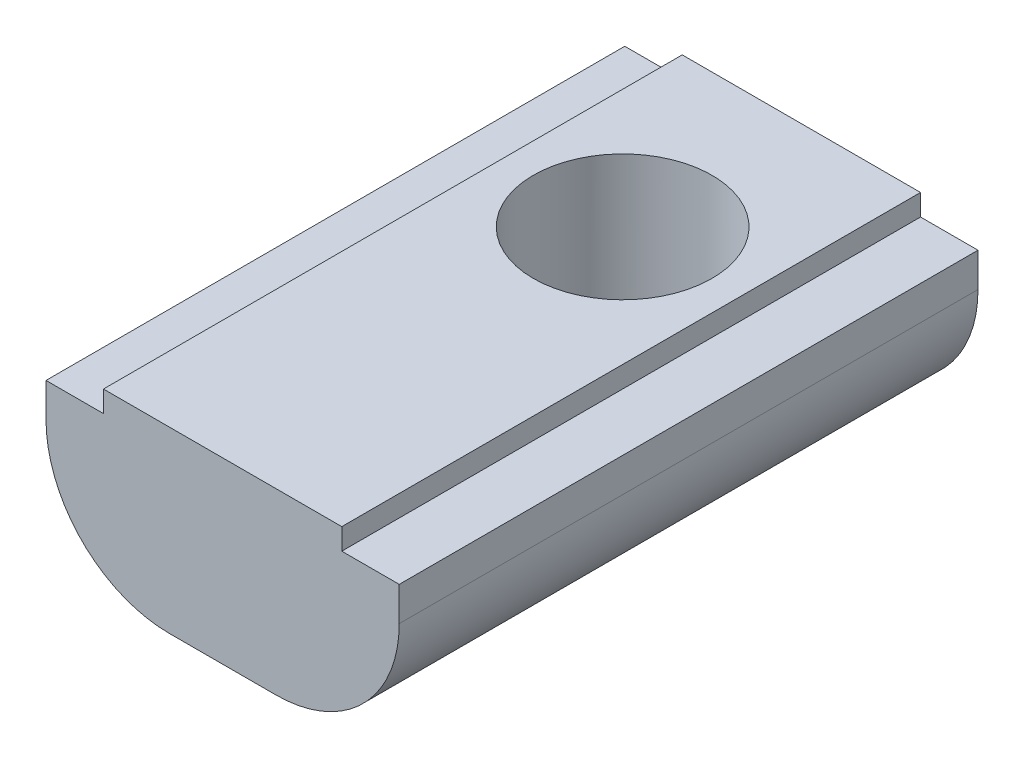
ISO-10303-21;
HEADER;
FILE_DESCRIPTION(('STEP AP214'),'2;1');
FILE_NAME('part.step','',(''),(''),'','','');
FILE_SCHEMA(('AUTOMOTIVE_DESIGN { 1 0 10303 214 1 1 1 1 }'));
ENDSEC;
DATA;
#1=APPLICATION_CONTEXT('core data for automotive mechanical design processes');
#2=APPLICATION_PROTOCOL_DEFINITION('international standard','automotive_design',2000,#1);
#3=PRODUCT_CONTEXT('',#1,'mechanical');
#4=PRODUCT('Part','Part','',(#3));
#5=PRODUCT_RELATED_PRODUCT_CATEGORY('part','',(#4));
#6=PRODUCT_DEFINITION_FORMATION('','',#4);
#7=PRODUCT_DEFINITION_CONTEXT('part definition',#1,'design');
#8=PRODUCT_DEFINITION('design','',#6,#7);
#9=PRODUCT_DEFINITION_SHAPE('','',#8);
#10=(LENGTH_UNIT() NAMED_UNIT(*) SI_UNIT(.MILLI.,.METRE.));
#11=(NAMED_UNIT(*) PLANE_ANGLE_UNIT() SI_UNIT($,.RADIAN.));
#12=(NAMED_UNIT(*) SI_UNIT($,.STERADIAN.) SOLID_ANGLE_UNIT());
#13=UNCERTAINTY_MEASURE_WITH_UNIT(LENGTH_MEASURE(1.E-05),#10,'distance_accuracy_value','');
#14=(GEOMETRIC_REPRESENTATION_CONTEXT(3) GLOBAL_UNCERTAINTY_ASSIGNED_CONTEXT((#13)) GLOBAL_UNIT_ASSIGNED_CONTEXT((#10,
#11,#12)) REPRESENTATION_CONTEXT('',''));
#15=CARTESIAN_POINT('',(0.,0.,0.));
#16=DIRECTION('',(0.,0.,1.));
#17=DIRECTION('',(1.,0.,0.));
#18=AXIS2_PLACEMENT_3D('',#15,#16,#17);
#19=CARTESIAN_POINT('',(1.25,-4.2,13.6));
#20=DIRECTION('',(0.,1.,0.));
#21=DIRECTION('',(0.,0.,1.));
#22=AXIS2_PLACEMENT_3D('',#19,#20,#21);
#23=PLANE('',#22);
#24=DIRECTION('',(0.,0.,-1.));
#25=VECTOR('',#24,1.);
#26=CARTESIAN_POINT('',(1.25,-4.2,13.6));
#27=LINE('',#26,#25);
#28=CARTESIAN_POINT('',(1.25,-4.2,2.51254629693139));
#29=VERTEX_POINT('',#28);
#30=CARTESIAN_POINT('',(1.25,-4.2,0.));
#31=VERTEX_POINT('',#30);
#32=EDGE_CURVE('E189',#29,#31,#27,.T.);
#33=ORIENTED_EDGE('',*,*,#32,.F.);
#34=CARTESIAN_POINT('',(0.,-4.2,4.2));
#35=DIRECTION('',(0.,1.,0.));
#36=DIRECTION('',(0.,0.,1.));
#37=AXIS2_PLACEMENT_3D('',#34,#35,#36);
#38=CIRCLE('',#37,2.1);
#39=CARTESIAN_POINT('',(-1.25,-4.2,2.51254629693138));
#40=VERTEX_POINT('',#39);
#41=EDGE_CURVE('E55',#29,#40,#38,.T.);
#42=ORIENTED_EDGE('',*,*,#41,.T.);
#43=DIRECTION('',(0.,0.,-1.));
#44=VECTOR('',#43,1.);
#45=CARTESIAN_POINT('',(-1.25,-4.2,13.6));
#46=LINE('',#45,#44);
#47=CARTESIAN_POINT('',(-1.25,-4.2,0.));
#48=VERTEX_POINT('',#47);
#49=EDGE_CURVE('E193',#40,#48,#46,.T.);
#50=ORIENTED_EDGE('',*,*,#49,.T.);
#51=DIRECTION('',(1.,0.,0.));
#52=VECTOR('',#51,1.);
#53=CARTESIAN_POINT('',(1.25,-4.2,0.));
#54=LINE('',#53,#52);
#55=EDGE_CURVE('E171',#48,#31,#54,.T.);
#56=ORIENTED_EDGE('',*,*,#55,.T.);
#57=EDGE_LOOP('',(#33,#42,#50,#56));
#58=FACE_BOUND('',#57,.T.);
#59=ADVANCED_FACE('F35',(#58),#23,.F.);
#60=CARTESIAN_POINT('',(-2.8,0.,13.6));
#61=DIRECTION('',(1.,0.,0.));
#62=DIRECTION('',(0.,0.,-1.));
#63=AXIS2_PLACEMENT_3D('',#60,#61,#62);
#64=PLANE('',#63);
#65=DIRECTION('',(0.,-1.,0.));
#66=VECTOR('',#65,1.);
#67=CARTESIAN_POINT('',(-2.8,0.,0.));
#68=LINE('',#67,#66);
#69=CARTESIAN_POINT('',(-2.8,0.,0.));
#70=VERTEX_POINT('',#69);
#71=CARTESIAN_POINT('',(-2.8,-0.500000000000001,0.));
#72=VERTEX_POINT('',#71);
#73=EDGE_CURVE('E160',#70,#72,#68,.T.);
#74=ORIENTED_EDGE('',*,*,#73,.T.);
#75=DIRECTION('',(0.,0.,-1.));
#76=VECTOR('',#75,1.);
#77=CARTESIAN_POINT('',(-2.8,-0.500000000000001,13.6));
#78=LINE('',#77,#76);
#79=CARTESIAN_POINT('',(-2.8,-0.500000000000001,13.6));
#80=VERTEX_POINT('',#79);
#81=EDGE_CURVE('E48',#80,#72,#78,.T.);
#82=ORIENTED_EDGE('',*,*,#81,.F.);
#83=DIRECTION('',(0.,-1.,0.));
#84=VECTOR('',#83,1.);
#85=CARTESIAN_POINT('',(-2.8,0.,13.6));
#86=LINE('',#85,#84);
#87=CARTESIAN_POINT('',(-2.8,0.,13.6));
#88=VERTEX_POINT('',#87);
#89=EDGE_CURVE('E182',#88,#80,#86,.T.);
#90=ORIENTED_EDGE('',*,*,#89,.F.);
#91=DIRECTION('',(0.,0.,-1.));
#92=VECTOR('',#91,1.);
#93=CARTESIAN_POINT('',(-2.8,0.,13.6));
#94=LINE('',#93,#92);
#95=EDGE_CURVE('E156',#88,#70,#94,.T.);
#96=ORIENTED_EDGE('',*,*,#95,.T.);
#97=EDGE_LOOP('',(#74,#82,#90,#96));
#98=FACE_BOUND('',#97,.T.);
#99=ADVANCED_FACE('F37',(#98),#64,.F.);
#100=CARTESIAN_POINT('',(-2.8,-0.500000000000001,13.6));
#101=DIRECTION('',(0.,-1.,0.));
#102=DIRECTION('',(1.,0.,0.));
#103=AXIS2_PLACEMENT_3D('',#100,#101,#102);
#104=PLANE('',#103);
#105=DIRECTION('',(-1.,0.,0.));
#106=VECTOR('',#105,1.);
#107=CARTESIAN_POINT('',(-2.8,-0.500000000000001,0.));
#108=LINE('',#107,#106);
#109=CARTESIAN_POINT('',(-4.15,-0.500000000000002,0.));
#110=VERTEX_POINT('',#109);
#111=EDGE_CURVE('E163',#72,#110,#108,.T.);
#112=ORIENTED_EDGE('',*,*,#111,.T.);
#113=DIRECTION('',(0.,0.,-1.));
#114=VECTOR('',#113,1.);
#115=CARTESIAN_POINT('',(-4.15,-0.500000000000002,13.6));
#116=LINE('',#115,#114);
#117=CARTESIAN_POINT('',(-4.15,-0.500000000000002,13.6));
#118=VERTEX_POINT('',#117);
#119=EDGE_CURVE('E200',#118,#110,#116,.T.);
#120=ORIENTED_EDGE('',*,*,#119,.F.);
#121=DIRECTION('',(-1.,0.,0.));
#122=VECTOR('',#121,1.);
#123=CARTESIAN_POINT('',(-2.8,-0.500000000000001,13.6));
#124=LINE('',#123,#122);
#125=EDGE_CURVE('E111',#80,#118,#124,.T.);
#126=ORIENTED_EDGE('',*,*,#125,.F.);
#127=ORIENTED_EDGE('',*,*,#81,.T.);
#128=EDGE_LOOP('',(#112,#120,#126,#127));
#129=FACE_BOUND('',#128,.T.);
#130=ADVANCED_FACE('F203',(#129),#104,.F.);
#131=CARTESIAN_POINT('',(-4.15,-0.500000000000002,13.6));
#132=DIRECTION('',(1.,0.,0.));
#133=DIRECTION('',(0.,1.,0.));
#134=AXIS2_PLACEMENT_3D('',#131,#132,#133);
#135=PLANE('',#134);
#136=DIRECTION('',(0.,-1.,0.));
#137=VECTOR('',#136,1.);
#138=CARTESIAN_POINT('',(-4.15,-0.500000000000002,0.));
#139=LINE('',#138,#137);
#140=CARTESIAN_POINT('',(-4.15,-1.3,0.));
#141=VERTEX_POINT('',#140);
#142=EDGE_CURVE('E166',#110,#141,#139,.T.);
#143=ORIENTED_EDGE('',*,*,#142,.T.);
#144=DIRECTION('',(0.,0.,-1.));
#145=VECTOR('',#144,1.);
#146=CARTESIAN_POINT('',(-4.15,-1.3,13.6));
#147=LINE('',#146,#145);
#148=CARTESIAN_POINT('',(-4.15,-1.3,13.6));
#149=VERTEX_POINT('',#148);
#150=EDGE_CURVE('E197',#149,#141,#147,.T.);
#151=ORIENTED_EDGE('',*,*,#150,.F.);
#152=DIRECTION('',(0.,-1.,0.));
#153=VECTOR('',#152,1.);
#154=CARTESIAN_POINT('',(-4.15,-0.500000000000002,13.6));
#155=LINE('',#154,#153);
#156=EDGE_CURVE('E225',#118,#149,#155,.T.);
#157=ORIENTED_EDGE('',*,*,#156,.F.);
#158=ORIENTED_EDGE('',*,*,#119,.T.);
#159=EDGE_LOOP('',(#143,#151,#157,#158));
#160=FACE_BOUND('',#159,.T.);
#161=ADVANCED_FACE('F214',(#160),#135,.F.);
#162=CARTESIAN_POINT('',(-1.25,-1.3,13.6));
#163=DIRECTION('',(0.,0.,-1.));
#164=DIRECTION('',(-1.,0.,0.));
#165=AXIS2_PLACEMENT_3D('',#162,#163,#164);
#166=CYLINDRICAL_SURFACE('',#165,2.9);
#167=ORIENTED_EDGE('',*,*,#49,.F.);
#168=CARTESIAN_POINT('',(-1.25,-4.2,2.51254629693139));
#169=CARTESIAN_POINT('',(-1.29679302358815,-4.20000162779569,2.54720613147119));
#170=CARTESIAN_POINT('',(-1.34210654962089,-4.19886739033813,2.58379078243395));
#171=CARTESIAN_POINT('',(-1.4294736763495,-4.19477086092717,2.66052497288662));
#172=CARTESIAN_POINT('',(-1.47152921453861,-4.19180966498832,2.70067236269233));
#173=CARTESIAN_POINT('',(-1.592248134523,-4.18086528521206,2.82589932642326));
#174=CARTESIAN_POINT('',(-1.66568861699531,-4.17081709738618,2.91593083823853));
#175=CARTESIAN_POINT('',(-1.79653736935906,-4.14880886083169,3.10646718108679));
#176=CARTESIAN_POINT('',(-1.85396894665814,-4.13685163182472,3.20695649052462));
#177=CARTESIAN_POINT('',(-1.95164145345667,-4.11428820760309,3.41615592729943));
#178=CARTESIAN_POINT('',(-1.99188016659913,-4.10368218669823,3.5248671124055));
#179=CARTESIAN_POINT('',(-2.05475080974325,-4.08630297770265,3.75050603803357));
#180=CARTESIAN_POINT('',(-2.07692477596599,-4.07963060370359,3.8675701892581));
#181=CARTESIAN_POINT('',(-2.10115925572021,-4.07230905515833,4.10392796490177));
#182=CARTESIAN_POINT('',(-2.10322722383182,-4.07165764825874,4.22322074658743));
#183=CARTESIAN_POINT('',(-2.08752919593551,-4.0764360699222,4.45531928550419));
#184=CARTESIAN_POINT('',(-2.07058949668459,-4.08161258036382,4.56818761625929));
#185=CARTESIAN_POINT('',(-2.01877355247524,-4.0963731756978,4.78947091338401));
#186=CARTESIAN_POINT('',(-1.98388735921023,-4.10595970489033,4.89788337369169));
#187=CARTESIAN_POINT('',(-1.89658041100682,-4.1273615966629,5.10896845544056));
#188=CARTESIAN_POINT('',(-1.8439163503699,-4.13920683519873,5.21153699074508));
#189=CARTESIAN_POINT('',(-1.72251496587779,-4.161909220898,5.40669827924429));
#190=CARTESIAN_POINT('',(-1.65379590412449,-4.17276747138328,5.49930219339976));
#191=CARTESIAN_POINT('',(-1.52885656363337,-4.18698274872469,5.64156955318508));
#192=CARTESIAN_POINT('',(-1.47682649154659,-4.19163447976084,5.69482718365556));
#193=CARTESIAN_POINT('',(-1.36734216390807,-4.19814513030808,5.79559425268969));
#194=CARTESIAN_POINT('',(-1.30988916461216,-4.20000469496297,5.84310501676177));
#195=CARTESIAN_POINT('',(-1.25,-4.2,5.88745370306861));
#196=B_SPLINE_CURVE_WITH_KNOTS('',3,(#168,#169,#170,#171,#172,#173,#174,#175,#176,#177,#178,
#179,#180,#181,#182,#183,#184,#185,#186,#187,#188,#189,#190,#191,#192,#193,#194,#195),
.UNSPECIFIED.,.F.,.F.,(4,2,2,2,2,2,2,2,2,2,2,2,2,4),(0.,0.174556159947332,0.349007703224587,
0.69708176058304,1.0446463771914,1.39225578534907,1.74842501068925,2.10446217626738,
2.44560159052293,2.78693031319363,3.1331337485854,3.47894528846722,3.70230915212592,
3.92562139851794),.UNSPECIFIED.);
#197=CARTESIAN_POINT('',(-1.25,-4.2,5.88745370306862));
#198=VERTEX_POINT('',#197);
#199=EDGE_CURVE('E164',#40,#198,#196,.T.);
#200=ORIENTED_EDGE('',*,*,#199,.T.);
#201=CARTESIAN_POINT('',(-1.25,-4.2,13.6));
#202=VERTEX_POINT('',#201);
#203=EDGE_CURVE('E194',#202,#198,#46,.T.);
#204=ORIENTED_EDGE('',*,*,#203,.F.);
#205=CARTESIAN_POINT('',(-1.25,-1.3,13.6));
#206=DIRECTION('',(0.,0.,1.));
#207=DIRECTION('',(-1.,0.,0.));
#208=AXIS2_PLACEMENT_3D('',#205,#206,#207);
#209=CIRCLE('',#208,2.9);
#210=EDGE_CURVE('E221',#149,#202,#209,.T.);
#211=ORIENTED_EDGE('',*,*,#210,.F.);
#212=ORIENTED_EDGE('',*,*,#150,.T.);
#213=CARTESIAN_POINT('',(-1.25,-1.3,0.));
#214=DIRECTION('',(0.,0.,1.));
#215=DIRECTION('',(-1.,0.,0.));
#216=AXIS2_PLACEMENT_3D('',#213,#214,#215);
#217=CIRCLE('',#216,2.9);
#218=EDGE_CURVE('E168',#141,#48,#217,.T.);
#219=ORIENTED_EDGE('',*,*,#218,.T.);
#220=EDGE_LOOP('',(#167,#200,#204,#211,#212,#219));
#221=FACE_BOUND('',#220,.T.);
#222=ADVANCED_FACE('F219',(#221),#166,.T.);
#223=ORIENTED_EDGE('',*,*,#203,.T.);
#224=CARTESIAN_POINT('',(1.25,-4.2,5.88745370306862));
#225=VERTEX_POINT('',#224);
#226=EDGE_CURVE('E249',#198,#225,#38,.T.);
#227=ORIENTED_EDGE('',*,*,#226,.T.);
#228=CARTESIAN_POINT('',(1.25,-4.2,13.6));
#229=VERTEX_POINT('',#228);
#230=EDGE_CURVE('E190',#229,#225,#27,.T.);
#231=ORIENTED_EDGE('',*,*,#230,.F.);
#232=DIRECTION('',(1.,0.,0.));
#233=VECTOR('',#232,1.);
#234=CARTESIAN_POINT('',(1.25,-4.2,13.6));
#235=LINE('',#234,#233);
#236=EDGE_CURVE('E224',#202,#229,#235,.T.);
#237=ORIENTED_EDGE('',*,*,#236,.F.);
#238=EDGE_LOOP('',(#223,#227,#231,#237));
#239=FACE_BOUND('',#238,.T.);
#240=ADVANCED_FACE('F274',(#239),#23,.F.);
#241=CARTESIAN_POINT('',(1.25,-1.3,13.6));
#242=DIRECTION('',(0.,0.,-1.));
#243=DIRECTION('',(-1.,0.,0.));
#244=AXIS2_PLACEMENT_3D('',#241,#242,#243);
#245=CYLINDRICAL_SURFACE('',#244,2.9);
#246=ORIENTED_EDGE('',*,*,#230,.T.);
#247=CARTESIAN_POINT('',(1.25,-4.2,5.88745370306861));
#248=CARTESIAN_POINT('',(1.29679302358816,-4.20000162779569,5.85279386852881));
#249=CARTESIAN_POINT('',(1.34210654962089,-4.19886739033813,5.81620921756605));
#250=CARTESIAN_POINT('',(1.4294736763495,-4.19477086092717,5.73947502711338));
#251=CARTESIAN_POINT('',(1.47152921453861,-4.19180966498832,5.69932763730767));
#252=CARTESIAN_POINT('',(1.592248134523,-4.18086528521206,5.57410067357674));
#253=CARTESIAN_POINT('',(1.66568861699531,-4.17081709738618,5.48406916176148));
#254=CARTESIAN_POINT('',(1.79653736935906,-4.14880886083169,5.29353281891321));
#255=CARTESIAN_POINT('',(1.85396894665814,-4.13685163182472,5.19304350947538));
#256=CARTESIAN_POINT('',(1.95164145345667,-4.11428820760309,4.98384407270057));
#257=CARTESIAN_POINT('',(1.99188016659913,-4.10368218669823,4.8751328875945));
#258=CARTESIAN_POINT('',(2.05475080974325,-4.08630297770265,4.64949396196644));
#259=CARTESIAN_POINT('',(2.07692477596599,-4.07963060370359,4.5324298107419));
#260=CARTESIAN_POINT('',(2.10115925572021,-4.07230905515833,4.29607203509823));
#261=CARTESIAN_POINT('',(2.10322722383183,-4.07165764825874,4.17677925341258));
#262=CARTESIAN_POINT('',(2.08752919593551,-4.0764360699222,3.94468071449581));
#263=CARTESIAN_POINT('',(2.0705894966846,-4.08161258036382,3.83181238374071));
#264=CARTESIAN_POINT('',(2.01877355247524,-4.0963731756978,3.610529086616));
#265=CARTESIAN_POINT('',(1.98388735921023,-4.10595970489033,3.50211662630831));
#266=CARTESIAN_POINT('',(1.89658041100682,-4.1273615966629,3.29103154455944));
#267=CARTESIAN_POINT('',(1.8439163503699,-4.13920683519873,3.18846300925493));
#268=CARTESIAN_POINT('',(1.72251496587779,-4.161909220898,2.99330172075571));
#269=CARTESIAN_POINT('',(1.65379590412449,-4.17276747138328,2.90069780660024));
#270=CARTESIAN_POINT('',(1.52885656363337,-4.18698274872469,2.75843044681492));
#271=CARTESIAN_POINT('',(1.47682649154659,-4.19163447976084,2.70517281634444));
#272=CARTESIAN_POINT('',(1.36734216390807,-4.19814513030808,2.60440574731031));
#273=CARTESIAN_POINT('',(1.30988916461216,-4.20000469496297,2.55689498323824));
#274=CARTESIAN_POINT('',(1.25,-4.2,2.51254629693139));
#275=B_SPLINE_CURVE_WITH_KNOTS('',3,(#247,#248,#249,#250,#251,#252,#253,#254,#255,#256,#257,
#258,#259,#260,#261,#262,#263,#264,#265,#266,#267,#268,#269,#270,#271,#272,#273,#274),
.UNSPECIFIED.,.F.,.F.,(4,2,2,2,2,2,2,2,2,2,2,2,2,4),(0.,0.174556159947332,0.349007703224586,
0.697081760583039,1.0446463771914,1.39225578534907,1.74842501068925,2.10446217626738,
2.44560159052293,2.78693031319363,3.1331337485854,3.47894528846721,3.70230915212592,
3.92562139851794),.UNSPECIFIED.);
#276=EDGE_CURVE('E11',#225,#29,#275,.T.);
#277=ORIENTED_EDGE('',*,*,#276,.T.);
#278=ORIENTED_EDGE('',*,*,#32,.T.);
#279=CARTESIAN_POINT('',(1.25,-1.3,0.));
#280=DIRECTION('',(0.,0.,1.));
#281=DIRECTION('',(1.,0.,0.));
#282=AXIS2_PLACEMENT_3D('',#279,#280,#281);
#283=CIRCLE('',#282,2.9);
#284=CARTESIAN_POINT('',(4.15,-1.3,0.));
#285=VERTEX_POINT('',#284);
#286=EDGE_CURVE('E174',#31,#285,#283,.T.);
#287=ORIENTED_EDGE('',*,*,#286,.T.);
#288=DIRECTION('',(0.,0.,-1.));
#289=VECTOR('',#288,1.);
#290=CARTESIAN_POINT('',(4.15,-1.3,13.6));
#291=LINE('',#290,#289);
#292=CARTESIAN_POINT('',(4.15,-1.3,13.6));
#293=VERTEX_POINT('',#292);
#294=EDGE_CURVE('E186',#293,#285,#291,.T.);
#295=ORIENTED_EDGE('',*,*,#294,.F.);
#296=CARTESIAN_POINT('',(1.25,-1.3,13.6));
#297=DIRECTION('',(0.,0.,1.));
#298=DIRECTION('',(1.,0.,0.));
#299=AXIS2_PLACEMENT_3D('',#296,#297,#298);
#300=CIRCLE('',#299,2.9);
#301=EDGE_CURVE('E227',#229,#293,#300,.T.);
#302=ORIENTED_EDGE('',*,*,#301,.F.);
#303=EDGE_LOOP('',(#246,#277,#278,#287,#295,#302));
#304=FACE_BOUND('',#303,.T.);
#305=ADVANCED_FACE('F236',(#304),#245,.T.);
#306=CARTESIAN_POINT('',(4.15,-0.500000000000002,13.6));
#307=DIRECTION('',(-1.,0.,0.));
#308=DIRECTION('',(0.,-1.,0.));
#309=AXIS2_PLACEMENT_3D('',#306,#307,#308);
#310=PLANE('',#309);
#311=DIRECTION('',(0.,1.,0.));
#312=VECTOR('',#311,1.);
#313=CARTESIAN_POINT('',(4.15,-0.500000000000002,0.));
#314=LINE('',#313,#312);
#315=CARTESIAN_POINT('',(4.15,-0.500000000000002,0.));
#316=VERTEX_POINT('',#315);
#317=EDGE_CURVE('E176',#285,#316,#314,.T.);
#318=ORIENTED_EDGE('',*,*,#317,.T.);
#319=DIRECTION('',(0.,0.,-1.));
#320=VECTOR('',#319,1.);
#321=CARTESIAN_POINT('',(4.15,-0.500000000000002,13.6));
#322=LINE('',#321,#320);
#323=CARTESIAN_POINT('',(4.15,-0.500000000000002,13.6));
#324=VERTEX_POINT('',#323);
#325=EDGE_CURVE('E151',#324,#316,#322,.T.);
#326=ORIENTED_EDGE('',*,*,#325,.F.);
#327=DIRECTION('',(0.,1.,0.));
#328=VECTOR('',#327,1.);
#329=CARTESIAN_POINT('',(4.15,-0.500000000000002,13.6));
#330=LINE('',#329,#328);
#331=EDGE_CURVE('E139',#293,#324,#330,.T.);
#332=ORIENTED_EDGE('',*,*,#331,.F.);
#333=ORIENTED_EDGE('',*,*,#294,.T.);
#334=EDGE_LOOP('',(#318,#326,#332,#333));
#335=FACE_BOUND('',#334,.T.);
#336=ADVANCED_FACE('F240',(#335),#310,.F.);
#337=CARTESIAN_POINT('',(2.8,-0.500000000000001,13.6));
#338=DIRECTION('',(0.,-1.,0.));
#339=DIRECTION('',(1.,0.,0.));
#340=AXIS2_PLACEMENT_3D('',#337,#338,#339);
#341=PLANE('',#340);
#342=DIRECTION('',(-1.,0.,0.));
#343=VECTOR('',#342,1.);
#344=CARTESIAN_POINT('',(2.8,-0.500000000000001,0.));
#345=LINE('',#344,#343);
#346=CARTESIAN_POINT('',(2.8,-0.500000000000001,0.));
#347=VERTEX_POINT('',#346);
#348=EDGE_CURVE('E148',#316,#347,#345,.T.);
#349=ORIENTED_EDGE('',*,*,#348,.T.);
#350=DIRECTION('',(0.,0.,-1.));
#351=VECTOR('',#350,1.);
#352=CARTESIAN_POINT('',(2.8,-0.500000000000001,13.6));
#353=LINE('',#352,#351);
#354=CARTESIAN_POINT('',(2.8,-0.500000000000001,13.6));
#355=VERTEX_POINT('',#354);
#356=EDGE_CURVE('E145',#355,#347,#353,.T.);
#357=ORIENTED_EDGE('',*,*,#356,.F.);
#358=DIRECTION('',(-1.,0.,0.));
#359=VECTOR('',#358,1.);
#360=CARTESIAN_POINT('',(2.8,-0.500000000000001,13.6));
#361=LINE('',#360,#359);
#362=EDGE_CURVE('E132',#324,#355,#361,.T.);
#363=ORIENTED_EDGE('',*,*,#362,.F.);
#364=ORIENTED_EDGE('',*,*,#325,.T.);
#365=EDGE_LOOP('',(#349,#357,#363,#364));
#366=FACE_BOUND('',#365,.T.);
#367=ADVANCED_FACE('F146',(#366),#341,.F.);
#368=CARTESIAN_POINT('',(2.8,0.,13.6));
#369=DIRECTION('',(-1.,0.,0.));
#370=DIRECTION('',(0.,0.,1.));
#371=AXIS2_PLACEMENT_3D('',#368,#369,#370);
#372=PLANE('',#371);
#373=DIRECTION('',(0.,1.,0.));
#374=VECTOR('',#373,1.);
#375=CARTESIAN_POINT('',(2.8,0.,0.));
#376=LINE('',#375,#374);
#377=CARTESIAN_POINT('',(2.8,0.,0.));
#378=VERTEX_POINT('',#377);
#379=EDGE_CURVE('E179',#347,#378,#376,.T.);
#380=ORIENTED_EDGE('',*,*,#379,.T.);
#381=DIRECTION('',(0.,0.,-1.));
#382=VECTOR('',#381,1.);
#383=CARTESIAN_POINT('',(2.8,0.,13.6));
#384=LINE('',#383,#382);
#385=CARTESIAN_POINT('',(2.8,0.,13.6));
#386=VERTEX_POINT('',#385);
#387=EDGE_CURVE('E152',#386,#378,#384,.T.);
#388=ORIENTED_EDGE('',*,*,#387,.F.);
#389=DIRECTION('',(0.,1.,0.));
#390=VECTOR('',#389,1.);
#391=CARTESIAN_POINT('',(2.8,0.,13.6));
#392=LINE('',#391,#390);
#393=EDGE_CURVE('E136',#355,#386,#392,.T.);
#394=ORIENTED_EDGE('',*,*,#393,.F.);
#395=ORIENTED_EDGE('',*,*,#356,.T.);
#396=EDGE_LOOP('',(#380,#388,#394,#395));
#397=FACE_BOUND('',#396,.T.);
#398=ADVANCED_FACE('F154',(#397),#372,.F.);
#399=CARTESIAN_POINT('',(2.8,0.,13.6));
#400=DIRECTION('',(0.,-1.,0.));
#401=DIRECTION('',(0.,0.,-1.));
#402=AXIS2_PLACEMENT_3D('',#399,#400,#401);
#403=PLANE('',#402);
#404=CARTESIAN_POINT('',(0.,0.,4.2));
#405=DIRECTION('',(0.,1.,0.));
#406=DIRECTION('',(0.,0.,1.));
#407=AXIS2_PLACEMENT_3D('',#404,#405,#406);
#408=CIRCLE('',#407,2.09999999999999);
#409=CARTESIAN_POINT('',(0.,0.,6.29999999999999));
#410=VERTEX_POINT('',#409);
#411=EDGE_CURVE('E291',#410,#410,#408,.T.);
#412=ORIENTED_EDGE('',*,*,#411,.F.);
#413=EDGE_LOOP('',(#412));
#414=FACE_BOUND('',#413,.T.);
#415=DIRECTION('',(-1.,0.,0.));
#416=VECTOR('',#415,1.);
#417=CARTESIAN_POINT('',(2.8,0.,0.));
#418=LINE('',#417,#416);
#419=EDGE_CURVE('E102',#378,#70,#418,.T.);
#420=ORIENTED_EDGE('',*,*,#419,.T.);
#421=ORIENTED_EDGE('',*,*,#95,.F.);
#422=DIRECTION('',(-1.,0.,0.));
#423=VECTOR('',#422,1.);
#424=CARTESIAN_POINT('',(2.8,0.,13.6));
#425=LINE('',#424,#423);
#426=EDGE_CURVE('E63',#386,#88,#425,.T.);
#427=ORIENTED_EDGE('',*,*,#426,.F.);
#428=ORIENTED_EDGE('',*,*,#387,.T.);
#429=EDGE_LOOP('',(#420,#421,#427,#428));
#430=FACE_BOUND('',#429,.T.);
#431=ADVANCED_FACE('F241',(#414,#430),#403,.F.);
#432=CARTESIAN_POINT('',(-1.25,-1.3,13.6));
#433=DIRECTION('',(0.,0.,-1.));
#434=DIRECTION('',(-1.,0.,0.));
#435=AXIS2_PLACEMENT_3D('',#432,#433,#434);
#436=PLANE('',#435);
#437=ORIENTED_EDGE('',*,*,#89,.T.);
#438=ORIENTED_EDGE('',*,*,#125,.T.);
#439=ORIENTED_EDGE('',*,*,#156,.T.);
#440=ORIENTED_EDGE('',*,*,#210,.T.);
#441=ORIENTED_EDGE('',*,*,#236,.T.);
#442=ORIENTED_EDGE('',*,*,#301,.T.);
#443=ORIENTED_EDGE('',*,*,#331,.T.);
#444=ORIENTED_EDGE('',*,*,#362,.T.);
#445=ORIENTED_EDGE('',*,*,#393,.T.);
#446=ORIENTED_EDGE('',*,*,#426,.T.);
#447=EDGE_LOOP('',(#437,#438,#439,#440,#441,#442,#443,#444,#445,#446));
#448=FACE_BOUND('',#447,.T.);
#449=ADVANCED_FACE('F134',(#448),#436,.F.);
#450=CARTESIAN_POINT('',(-1.25,-1.3,0.));
#451=DIRECTION('',(0.,0.,-1.));
#452=DIRECTION('',(-1.,0.,0.));
#453=AXIS2_PLACEMENT_3D('',#450,#451,#452);
#454=PLANE('',#453);
#455=ORIENTED_EDGE('',*,*,#73,.F.);
#456=ORIENTED_EDGE('',*,*,#419,.F.);
#457=ORIENTED_EDGE('',*,*,#379,.F.);
#458=ORIENTED_EDGE('',*,*,#348,.F.);
#459=ORIENTED_EDGE('',*,*,#317,.F.);
#460=ORIENTED_EDGE('',*,*,#286,.F.);
#461=ORIENTED_EDGE('',*,*,#55,.F.);
#462=ORIENTED_EDGE('',*,*,#218,.F.);
#463=ORIENTED_EDGE('',*,*,#142,.F.);
#464=ORIENTED_EDGE('',*,*,#111,.F.);
#465=EDGE_LOOP('',(#455,#456,#457,#458,#459,#460,#461,#462,#463,#464));
#466=FACE_BOUND('',#465,.T.);
#467=ADVANCED_FACE('F208',(#466),#454,.T.);
#468=CARTESIAN_POINT('',(0.,0.,4.2));
#469=DIRECTION('',(0.,1.,0.));
#470=DIRECTION('',(0.,0.,1.));
#471=AXIS2_PLACEMENT_3D('',#468,#469,#470);
#472=CYLINDRICAL_SURFACE('',#471,2.09999999999999);
#473=ORIENTED_EDGE('',*,*,#411,.T.);
#474=EDGE_LOOP('',(#473));
#475=FACE_BOUND('',#474,.T.);
#476=ORIENTED_EDGE('',*,*,#41,.F.);
#477=ORIENTED_EDGE('',*,*,#276,.F.);
#478=ORIENTED_EDGE('',*,*,#226,.F.);
#479=ORIENTED_EDGE('',*,*,#199,.F.);
#480=EDGE_LOOP('',(#476,#477,#478,#479));
#481=FACE_BOUND('',#480,.T.);
#482=ADVANCED_FACE('F254',(#475,#481),#472,.F.);
#483=CLOSED_SHELL('',(#59,#99,#130,#161,#222,#240,#305,#336,#367,#398,#431,#449,#467,#482));
#484=MANIFOLD_SOLID_BREP('B2',#483);
#485=ADVANCED_BREP_SHAPE_REPRESENTATION('',(#18,#484),#14);
#486=SHAPE_DEFINITION_REPRESENTATION(#9,#485);
ENDSEC;
END-ISO-10303-21;
